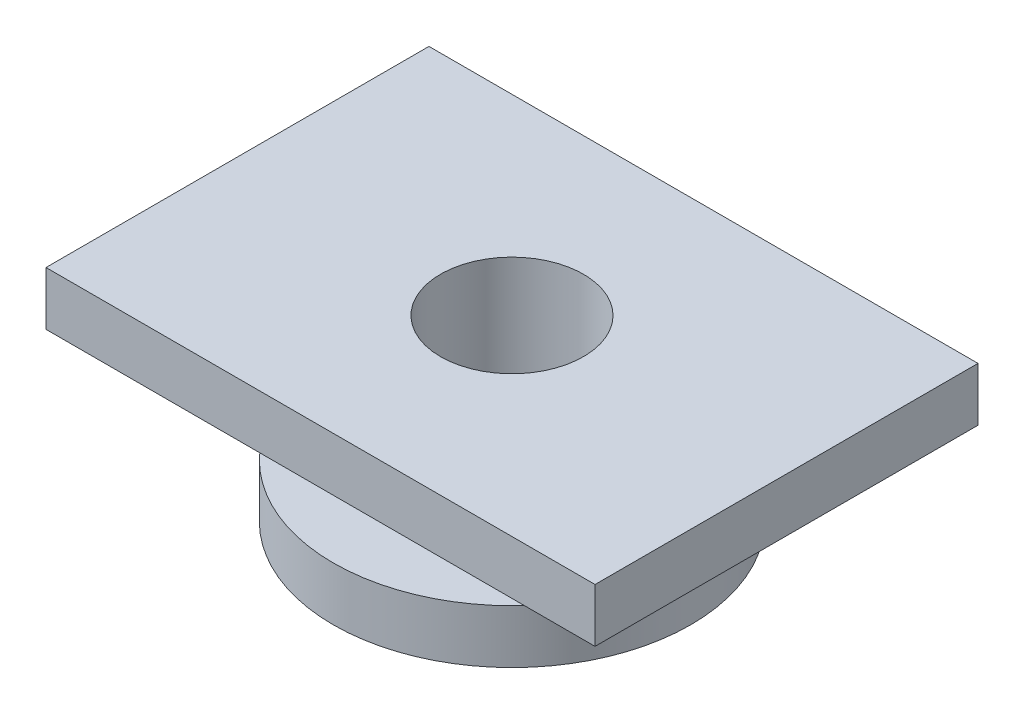
ISO-10303-21;
HEADER;
FILE_DESCRIPTION(('STEP AP214'),'2;1');
FILE_NAME('part.step','',(''),(''),'','','');
FILE_SCHEMA(('AUTOMOTIVE_DESIGN { 1 0 10303 214 1 1 1 1 }'));
ENDSEC;
DATA;
#1=APPLICATION_CONTEXT('core data for automotive mechanical design processes');
#2=APPLICATION_PROTOCOL_DEFINITION('international standard','automotive_design',2000,#1);
#3=PRODUCT_CONTEXT('',#1,'mechanical');
#4=PRODUCT('Part','Part','',(#3));
#5=PRODUCT_RELATED_PRODUCT_CATEGORY('part','',(#4));
#6=PRODUCT_DEFINITION_FORMATION('','',#4);
#7=PRODUCT_DEFINITION_CONTEXT('part definition',#1,'design');
#8=PRODUCT_DEFINITION('design','',#6,#7);
#9=PRODUCT_DEFINITION_SHAPE('','',#8);
#10=(LENGTH_UNIT() NAMED_UNIT(*) SI_UNIT(.MILLI.,.METRE.));
#11=(NAMED_UNIT(*) PLANE_ANGLE_UNIT() SI_UNIT($,.RADIAN.));
#12=(NAMED_UNIT(*) SI_UNIT($,.STERADIAN.) SOLID_ANGLE_UNIT());
#13=UNCERTAINTY_MEASURE_WITH_UNIT(LENGTH_MEASURE(1.E-05),#10,'distance_accuracy_value','');
#14=(GEOMETRIC_REPRESENTATION_CONTEXT(3) GLOBAL_UNCERTAINTY_ASSIGNED_CONTEXT((#13)) GLOBAL_UNIT_ASSIGNED_CONTEXT((#10,
#11,#12)) REPRESENTATION_CONTEXT('',''));
#15=CARTESIAN_POINT('',(0.,0.,0.));
#16=DIRECTION('',(0.,0.,1.));
#17=DIRECTION('',(1.,0.,0.));
#18=AXIS2_PLACEMENT_3D('',#15,#16,#17);
#19=CARTESIAN_POINT('',(0.,1.5,0.));
#20=DIRECTION('',(0.,1.,0.));
#21=DIRECTION('',(0.,0.,1.));
#22=AXIS2_PLACEMENT_3D('',#19,#20,#21);
#23=PLANE('',#22);
#24=CARTESIAN_POINT('',(0.,1.5,0.));
#25=DIRECTION('',(0.,1.,0.));
#26=DIRECTION('',(0.,0.,1.));
#27=AXIS2_PLACEMENT_3D('',#24,#25,#26);
#28=CIRCLE('',#27,10.);
#29=CARTESIAN_POINT('',(0.,1.5,10.));
#30=VERTEX_POINT('',#29);
#31=EDGE_CURVE('E11',#30,#30,#28,.T.);
#32=ORIENTED_EDGE('',*,*,#31,.T.);
#33=EDGE_LOOP('',(#32));
#34=FACE_BOUND('',#33,.T.);
#35=CARTESIAN_POINT('',(0.,1.5,0.));
#36=DIRECTION('',(0.,1.,0.));
#37=DIRECTION('',(0.,0.,1.));
#38=AXIS2_PLACEMENT_3D('',#35,#36,#37);
#39=CIRCLE('',#38,6.);
#40=CARTESIAN_POINT('',(0.,1.5,6.));
#41=VERTEX_POINT('',#40);
#42=EDGE_CURVE('E116',#41,#41,#39,.T.);
#43=ORIENTED_EDGE('',*,*,#42,.F.);
#44=EDGE_LOOP('',(#43));
#45=FACE_BOUND('',#44,.T.);
#46=ADVANCED_FACE('F37',(#34,#45),#23,.T.);
#47=CARTESIAN_POINT('',(0.,-1.5,0.));
#48=DIRECTION('',(0.,1.,0.));
#49=DIRECTION('',(0.,0.,1.));
#50=AXIS2_PLACEMENT_3D('',#47,#48,#49);
#51=PLANE('',#50);
#52=CARTESIAN_POINT('',(0.,-1.5,0.));
#53=DIRECTION('',(0.,1.,0.));
#54=DIRECTION('',(0.,0.,1.));
#55=AXIS2_PLACEMENT_3D('',#52,#53,#54);
#56=CIRCLE('',#55,10.);
#57=CARTESIAN_POINT('',(0.,-1.5,10.));
#58=VERTEX_POINT('',#57);
#59=EDGE_CURVE('E41',#58,#58,#56,.T.);
#60=ORIENTED_EDGE('',*,*,#59,.F.);
#61=EDGE_LOOP('',(#60));
#62=FACE_BOUND('',#61,.T.);
#63=CARTESIAN_POINT('',(0.,-1.5,0.));
#64=DIRECTION('',(0.,1.,0.));
#65=DIRECTION('',(0.,0.,1.));
#66=AXIS2_PLACEMENT_3D('',#63,#64,#65);
#67=CIRCLE('',#66,4.);
#68=CARTESIAN_POINT('',(0.,-1.5,4.));
#69=VERTEX_POINT('',#68);
#70=EDGE_CURVE('E120',#69,#69,#67,.T.);
#71=ORIENTED_EDGE('',*,*,#70,.T.);
#72=EDGE_LOOP('',(#71));
#73=FACE_BOUND('',#72,.T.);
#74=ADVANCED_FACE('F130',(#62,#73),#51,.F.);
#75=CARTESIAN_POINT('',(0.,1.5,0.));
#76=DIRECTION('',(0.,-1.,0.));
#77=DIRECTION('',(0.,0.,-1.));
#78=AXIS2_PLACEMENT_3D('',#75,#76,#77);
#79=CYLINDRICAL_SURFACE('',#78,10.);
#80=ORIENTED_EDGE('',*,*,#31,.F.);
#81=EDGE_LOOP('',(#80));
#82=FACE_BOUND('',#81,.T.);
#83=ORIENTED_EDGE('',*,*,#59,.T.);
#84=EDGE_LOOP('',(#83));
#85=FACE_BOUND('',#84,.T.);
#86=ADVANCED_FACE('F39',(#82,#85),#79,.T.);
#87=CARTESIAN_POINT('',(0.,1.5,0.));
#88=DIRECTION('',(0.,-1.,0.));
#89=DIRECTION('',(0.,0.,-1.));
#90=AXIS2_PLACEMENT_3D('',#87,#88,#89);
#91=CYLINDRICAL_SURFACE('',#90,4.);
#92=ORIENTED_EDGE('',*,*,#70,.F.);
#93=EDGE_LOOP('',(#92));
#94=FACE_BOUND('',#93,.T.);
#95=CARTESIAN_POINT('',(0.,8.5,0.));
#96=DIRECTION('',(0.,1.,0.));
#97=DIRECTION('',(0.,0.,1.));
#98=AXIS2_PLACEMENT_3D('',#95,#96,#97);
#99=CIRCLE('',#98,4.);
#100=CARTESIAN_POINT('',(0.,8.5,4.));
#101=VERTEX_POINT('',#100);
#102=EDGE_CURVE('E109',#101,#101,#99,.T.);
#103=ORIENTED_EDGE('',*,*,#102,.T.);
#104=EDGE_LOOP('',(#103));
#105=FACE_BOUND('',#104,.T.);
#106=ADVANCED_FACE('F135',(#94,#105),#91,.F.);
#107=CARTESIAN_POINT('',(0.,5.5,0.));
#108=DIRECTION('',(0.,-1.,0.));
#109=DIRECTION('',(0.,0.,-1.));
#110=AXIS2_PLACEMENT_3D('',#107,#108,#109);
#111=CYLINDRICAL_SURFACE('',#110,6.);
#112=CARTESIAN_POINT('',(0.,5.5,0.));
#113=DIRECTION('',(0.,1.,0.));
#114=DIRECTION('',(0.,0.,1.));
#115=AXIS2_PLACEMENT_3D('',#112,#113,#114);
#116=CIRCLE('',#115,6.);
#117=CARTESIAN_POINT('',(0.,5.5,6.));
#118=VERTEX_POINT('',#117);
#119=EDGE_CURVE('E117',#118,#118,#116,.T.);
#120=ORIENTED_EDGE('',*,*,#119,.F.);
#121=EDGE_LOOP('',(#120));
#122=FACE_BOUND('',#121,.T.);
#123=ORIENTED_EDGE('',*,*,#42,.T.);
#124=EDGE_LOOP('',(#123));
#125=FACE_BOUND('',#124,.T.);
#126=ADVANCED_FACE('F143',(#122,#125),#111,.T.);
#127=CARTESIAN_POINT('',(0.,8.5,0.));
#128=DIRECTION('',(0.,1.,0.));
#129=DIRECTION('',(0.,0.,1.));
#130=AXIS2_PLACEMENT_3D('',#127,#128,#129);
#131=PLANE('',#130);
#132=DIRECTION('',(0.,0.,-1.));
#133=VECTOR('',#132,1.);
#134=CARTESIAN_POINT('',(15.3653848448313,8.5,-10.7177631391156));
#135=LINE('',#134,#133);
#136=CARTESIAN_POINT('',(15.3653848448313,8.5,10.7177631391156));
#137=VERTEX_POINT('',#136);
#138=CARTESIAN_POINT('',(15.3653848448313,8.5,-10.7177631391156));
#139=VERTEX_POINT('',#138);
#140=EDGE_CURVE('E91',#137,#139,#135,.T.);
#141=ORIENTED_EDGE('',*,*,#140,.T.);
#142=DIRECTION('',(-1.,0.,0.));
#143=VECTOR('',#142,1.);
#144=CARTESIAN_POINT('',(-15.3653848448313,8.5,-10.7177631391156));
#145=LINE('',#144,#143);
#146=CARTESIAN_POINT('',(-15.3653848448313,8.5,-10.7177631391156));
#147=VERTEX_POINT('',#146);
#148=EDGE_CURVE('E85',#139,#147,#145,.T.);
#149=ORIENTED_EDGE('',*,*,#148,.T.);
#150=DIRECTION('',(0.,0.,1.));
#151=VECTOR('',#150,1.);
#152=CARTESIAN_POINT('',(-15.3653848448313,8.5,-10.7177631391156));
#153=LINE('',#152,#151);
#154=CARTESIAN_POINT('',(-15.3653848448313,8.5,10.7177631391156));
#155=VERTEX_POINT('',#154);
#156=EDGE_CURVE('E89',#147,#155,#153,.T.);
#157=ORIENTED_EDGE('',*,*,#156,.T.);
#158=DIRECTION('',(1.,0.,0.));
#159=VECTOR('',#158,1.);
#160=CARTESIAN_POINT('',(-15.3653848448313,8.5,10.7177631391156));
#161=LINE('',#160,#159);
#162=EDGE_CURVE('E54',#155,#137,#161,.T.);
#163=ORIENTED_EDGE('',*,*,#162,.T.);
#164=EDGE_LOOP('',(#141,#149,#157,#163));
#165=FACE_BOUND('',#164,.T.);
#166=ORIENTED_EDGE('',*,*,#102,.F.);
#167=EDGE_LOOP('',(#166));
#168=FACE_BOUND('',#167,.T.);
#169=ADVANCED_FACE('F86',(#165,#168),#131,.T.);
#170=CARTESIAN_POINT('',(0.,5.5,0.));
#171=DIRECTION('',(0.,1.,0.));
#172=DIRECTION('',(0.,0.,1.));
#173=AXIS2_PLACEMENT_3D('',#170,#171,#172);
#174=PLANE('',#173);
#175=ORIENTED_EDGE('',*,*,#119,.T.);
#176=EDGE_LOOP('',(#175));
#177=FACE_BOUND('',#176,.T.);
#178=DIRECTION('',(0.,0.,-1.));
#179=VECTOR('',#178,1.);
#180=CARTESIAN_POINT('',(15.3653848448313,5.5,-10.7177631391156));
#181=LINE('',#180,#179);
#182=CARTESIAN_POINT('',(15.3653848448313,5.5,10.7177631391156));
#183=VERTEX_POINT('',#182);
#184=CARTESIAN_POINT('',(15.3653848448313,5.5,-10.7177631391156));
#185=VERTEX_POINT('',#184);
#186=EDGE_CURVE('E106',#183,#185,#181,.T.);
#187=ORIENTED_EDGE('',*,*,#186,.F.);
#188=DIRECTION('',(1.,0.,0.));
#189=VECTOR('',#188,1.);
#190=CARTESIAN_POINT('',(-15.3653848448313,5.5,10.7177631391156));
#191=LINE('',#190,#189);
#192=CARTESIAN_POINT('',(-15.3653848448313,5.5,10.7177631391156));
#193=VERTEX_POINT('',#192);
#194=EDGE_CURVE('E77',#193,#183,#191,.T.);
#195=ORIENTED_EDGE('',*,*,#194,.F.);
#196=DIRECTION('',(0.,0.,1.));
#197=VECTOR('',#196,1.);
#198=CARTESIAN_POINT('',(-15.3653848448313,5.5,-10.7177631391156));
#199=LINE('',#198,#197);
#200=CARTESIAN_POINT('',(-15.3653848448313,5.5,-10.7177631391156));
#201=VERTEX_POINT('',#200);
#202=EDGE_CURVE('E71',#201,#193,#199,.T.);
#203=ORIENTED_EDGE('',*,*,#202,.F.);
#204=DIRECTION('',(-1.,0.,0.));
#205=VECTOR('',#204,1.);
#206=CARTESIAN_POINT('',(-15.3653848448313,5.5,-10.7177631391156));
#207=LINE('',#206,#205);
#208=EDGE_CURVE('E96',#185,#201,#207,.T.);
#209=ORIENTED_EDGE('',*,*,#208,.F.);
#210=EDGE_LOOP('',(#187,#195,#203,#209));
#211=FACE_BOUND('',#210,.T.);
#212=ADVANCED_FACE('F151',(#177,#211),#174,.F.);
#213=CARTESIAN_POINT('',(15.3653848448313,8.5,-10.7177631391156));
#214=DIRECTION('',(-1.,0.,0.));
#215=DIRECTION('',(0.,0.,1.));
#216=AXIS2_PLACEMENT_3D('',#213,#214,#215);
#217=PLANE('',#216);
#218=ORIENTED_EDGE('',*,*,#186,.T.);
#219=DIRECTION('',(0.,-1.,0.));
#220=VECTOR('',#219,1.);
#221=CARTESIAN_POINT('',(15.3653848448313,8.5,-10.7177631391156));
#222=LINE('',#221,#220);
#223=EDGE_CURVE('E97',#139,#185,#222,.T.);
#224=ORIENTED_EDGE('',*,*,#223,.F.);
#225=ORIENTED_EDGE('',*,*,#140,.F.);
#226=DIRECTION('',(0.,-1.,0.));
#227=VECTOR('',#226,1.);
#228=CARTESIAN_POINT('',(15.3653848448313,8.5,10.7177631391156));
#229=LINE('',#228,#227);
#230=EDGE_CURVE('E102',#137,#183,#229,.T.);
#231=ORIENTED_EDGE('',*,*,#230,.T.);
#232=EDGE_LOOP('',(#218,#224,#225,#231));
#233=FACE_BOUND('',#232,.T.);
#234=ADVANCED_FACE('F148',(#233),#217,.F.);
#235=CARTESIAN_POINT('',(-15.3653848448313,8.5,-10.7177631391156));
#236=DIRECTION('',(0.,0.,1.));
#237=DIRECTION('',(1.,0.,0.));
#238=AXIS2_PLACEMENT_3D('',#235,#236,#237);
#239=PLANE('',#238);
#240=ORIENTED_EDGE('',*,*,#208,.T.);
#241=DIRECTION('',(0.,-1.,0.));
#242=VECTOR('',#241,1.);
#243=CARTESIAN_POINT('',(-15.3653848448313,8.5,-10.7177631391156));
#244=LINE('',#243,#242);
#245=EDGE_CURVE('E94',#147,#201,#244,.T.);
#246=ORIENTED_EDGE('',*,*,#245,.F.);
#247=ORIENTED_EDGE('',*,*,#148,.F.);
#248=ORIENTED_EDGE('',*,*,#223,.T.);
#249=EDGE_LOOP('',(#240,#246,#247,#248));
#250=FACE_BOUND('',#249,.T.);
#251=ADVANCED_FACE('F95',(#250),#239,.F.);
#252=CARTESIAN_POINT('',(-15.3653848448313,8.5,-10.7177631391156));
#253=DIRECTION('',(1.,0.,0.));
#254=DIRECTION('',(0.,0.,-1.));
#255=AXIS2_PLACEMENT_3D('',#252,#253,#254);
#256=PLANE('',#255);
#257=ORIENTED_EDGE('',*,*,#202,.T.);
#258=DIRECTION('',(0.,-1.,0.));
#259=VECTOR('',#258,1.);
#260=CARTESIAN_POINT('',(-15.3653848448313,8.5,10.7177631391156));
#261=LINE('',#260,#259);
#262=EDGE_CURVE('E98',#155,#193,#261,.T.);
#263=ORIENTED_EDGE('',*,*,#262,.F.);
#264=ORIENTED_EDGE('',*,*,#156,.F.);
#265=ORIENTED_EDGE('',*,*,#245,.T.);
#266=EDGE_LOOP('',(#257,#263,#264,#265));
#267=FACE_BOUND('',#266,.T.);
#268=ADVANCED_FACE('F100',(#267),#256,.F.);
#269=CARTESIAN_POINT('',(-15.3653848448313,8.5,10.7177631391156));
#270=DIRECTION('',(0.,0.,-1.));
#271=DIRECTION('',(-1.,0.,0.));
#272=AXIS2_PLACEMENT_3D('',#269,#270,#271);
#273=PLANE('',#272);
#274=ORIENTED_EDGE('',*,*,#194,.T.);
#275=ORIENTED_EDGE('',*,*,#230,.F.);
#276=ORIENTED_EDGE('',*,*,#162,.F.);
#277=ORIENTED_EDGE('',*,*,#262,.T.);
#278=EDGE_LOOP('',(#274,#275,#276,#277));
#279=FACE_BOUND('',#278,.T.);
#280=ADVANCED_FACE('F157',(#279),#273,.F.);
#281=CLOSED_SHELL('',(#46,#74,#86,#106,#126,#169,#212,#234,#251,#268,#280));
#282=MANIFOLD_SOLID_BREP('B2',#281);
#283=ADVANCED_BREP_SHAPE_REPRESENTATION('',(#18,#282),#14);
#284=SHAPE_DEFINITION_REPRESENTATION(#9,#283);
ENDSEC;
END-ISO-10303-21;
